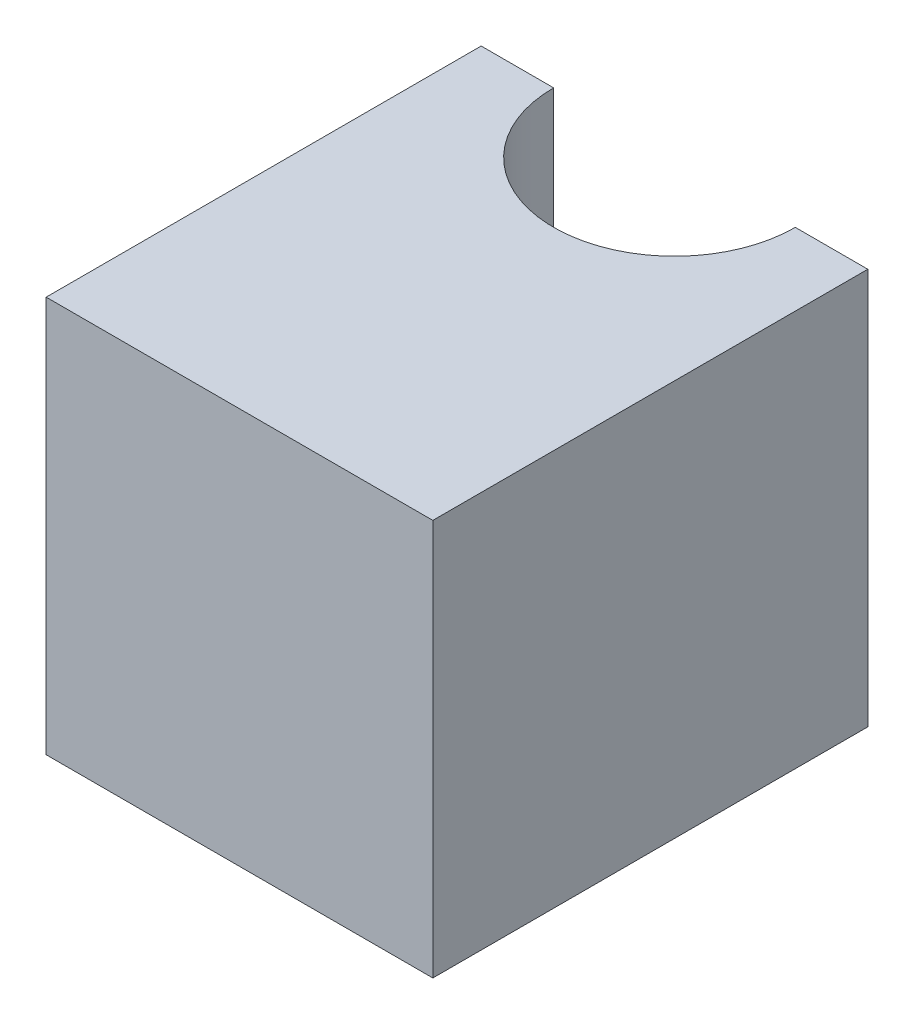
ISO-10303-21;
HEADER;
FILE_DESCRIPTION(('STEP AP214'),'2;1');
FILE_NAME('part.step','',(''),(''),'','','');
FILE_SCHEMA(('AUTOMOTIVE_DESIGN { 1 0 10303 214 1 1 1 1 }'));
ENDSEC;
DATA;
#1=APPLICATION_CONTEXT('core data for automotive mechanical design processes');
#2=APPLICATION_PROTOCOL_DEFINITION('international standard','automotive_design',2000,#1);
#3=PRODUCT_CONTEXT('',#1,'mechanical');
#4=PRODUCT('Part','Part','',(#3));
#5=PRODUCT_RELATED_PRODUCT_CATEGORY('part','',(#4));
#6=PRODUCT_DEFINITION_FORMATION('','',#4);
#7=PRODUCT_DEFINITION_CONTEXT('part definition',#1,'design');
#8=PRODUCT_DEFINITION('design','',#6,#7);
#9=PRODUCT_DEFINITION_SHAPE('','',#8);
#10=(LENGTH_UNIT() NAMED_UNIT(*) SI_UNIT(.MILLI.,.METRE.));
#11=(NAMED_UNIT(*) PLANE_ANGLE_UNIT() SI_UNIT($,.RADIAN.));
#12=(NAMED_UNIT(*) SI_UNIT($,.STERADIAN.) SOLID_ANGLE_UNIT());
#13=UNCERTAINTY_MEASURE_WITH_UNIT(LENGTH_MEASURE(1.E-05),#10,'distance_accuracy_value','');
#14=(GEOMETRIC_REPRESENTATION_CONTEXT(3) GLOBAL_UNCERTAINTY_ASSIGNED_CONTEXT((#13)) GLOBAL_UNIT_ASSIGNED_CONTEXT((#10,
#11,#12)) REPRESENTATION_CONTEXT('',''));
#15=CARTESIAN_POINT('',(0.,0.,0.));
#16=DIRECTION('',(0.,0.,1.));
#17=DIRECTION('',(1.,0.,0.));
#18=AXIS2_PLACEMENT_3D('',#15,#16,#17);
#19=CARTESIAN_POINT('',(0.8,0.,-5.2));
#20=DIRECTION('',(1.,0.,0.));
#21=DIRECTION('',(0.,0.,-1.));
#22=AXIS2_PLACEMENT_3D('',#19,#20,#21);
#23=PLANE('',#22);
#24=DIRECTION('',(0.,0.,1.));
#25=VECTOR('',#24,1.);
#26=CARTESIAN_POINT('',(0.8,0.82,-5.65));
#27=LINE('',#26,#25);
#28=CARTESIAN_POINT('',(0.8,0.82,-5.2));
#29=VERTEX_POINT('',#28);
#30=CARTESIAN_POINT('',(0.8,0.82,-6.1));
#31=VERTEX_POINT('',#30);
#32=EDGE_CURVE('E108',#29,#31,#27,.F.);
#33=ORIENTED_EDGE('',*,*,#32,.F.);
#34=DIRECTION('',(0.,1.,0.));
#35=VECTOR('',#34,1.);
#36=CARTESIAN_POINT('',(0.8,0.,-5.2));
#37=LINE('',#36,#35);
#38=CARTESIAN_POINT('',(0.8,0.,-5.2));
#39=VERTEX_POINT('',#38);
#40=EDGE_CURVE('E92',#39,#29,#37,.T.);
#41=ORIENTED_EDGE('',*,*,#40,.F.);
#42=DIRECTION('',(0.,0.,1.));
#43=VECTOR('',#42,1.);
#44=CARTESIAN_POINT('',(0.8,0.,-5.65));
#45=LINE('',#44,#43);
#46=CARTESIAN_POINT('',(0.8,0.,-6.1));
#47=VERTEX_POINT('',#46);
#48=EDGE_CURVE('E76',#39,#47,#45,.F.);
#49=ORIENTED_EDGE('',*,*,#48,.T.);
#50=DIRECTION('',(0.,1.,0.));
#51=VECTOR('',#50,1.);
#52=CARTESIAN_POINT('',(0.8,0.,-6.1));
#53=LINE('',#52,#51);
#54=EDGE_CURVE('E73',#31,#47,#53,.F.);
#55=ORIENTED_EDGE('',*,*,#54,.F.);
#56=EDGE_LOOP('',(#33,#41,#49,#55));
#57=FACE_BOUND('',#56,.T.);
#58=ADVANCED_FACE('F17',(#57),#23,.T.);
#59=CARTESIAN_POINT('',(0.8,0.,-6.1));
#60=DIRECTION('',(0.,0.,-1.));
#61=DIRECTION('',(-1.,0.,0.));
#62=AXIS2_PLACEMENT_3D('',#59,#60,#61);
#63=PLANE('',#62);
#64=DIRECTION('',(1.,0.,0.));
#65=VECTOR('',#64,1.);
#66=CARTESIAN_POINT('',(0.4,0.82,-6.1));
#67=LINE('',#66,#65);
#68=CARTESIAN_POINT('',(0.65,0.82,-6.1));
#69=VERTEX_POINT('',#68);
#70=EDGE_CURVE('E106',#31,#69,#67,.F.);
#71=ORIENTED_EDGE('',*,*,#70,.F.);
#72=ORIENTED_EDGE('',*,*,#54,.T.);
#73=DIRECTION('',(1.,0.,0.));
#74=VECTOR('',#73,1.);
#75=CARTESIAN_POINT('',(0.4,0.,-6.1));
#76=LINE('',#75,#74);
#77=CARTESIAN_POINT('',(0.65,0.,-6.1));
#78=VERTEX_POINT('',#77);
#79=EDGE_CURVE('E67',#47,#78,#76,.F.);
#80=ORIENTED_EDGE('',*,*,#79,.T.);
#81=DIRECTION('',(0.,1.,0.));
#82=VECTOR('',#81,1.);
#83=CARTESIAN_POINT('',(0.65,0.,-6.1));
#84=LINE('',#83,#82);
#85=EDGE_CURVE('E71',#78,#69,#84,.T.);
#86=ORIENTED_EDGE('',*,*,#85,.T.);
#87=EDGE_LOOP('',(#71,#72,#80,#86));
#88=FACE_BOUND('',#87,.T.);
#89=ADVANCED_FACE('F70',(#88),#63,.T.);
#90=CARTESIAN_POINT('',(0.4,0.,-6.1));
#91=DIRECTION('',(0.,1.,0.));
#92=DIRECTION('',(0.,0.,1.));
#93=AXIS2_PLACEMENT_3D('',#90,#91,#92);
#94=CYLINDRICAL_SURFACE('',#93,0.25);
#95=DIRECTION('',(0.,1.,0.));
#96=VECTOR('',#95,1.);
#97=CARTESIAN_POINT('',(0.15,0.,-6.1));
#98=LINE('',#97,#96);
#99=CARTESIAN_POINT('',(0.15,0.82,-6.1));
#100=VERTEX_POINT('',#99);
#101=CARTESIAN_POINT('',(0.15,0.,-6.1));
#102=VERTEX_POINT('',#101);
#103=EDGE_CURVE('E117',#100,#102,#98,.F.);
#104=ORIENTED_EDGE('',*,*,#103,.F.);
#105=CARTESIAN_POINT('',(0.4,0.82,-6.1));
#106=DIRECTION('',(0.,1.,0.));
#107=DIRECTION('',(0.,0.,1.));
#108=AXIS2_PLACEMENT_3D('',#105,#106,#107);
#109=CIRCLE('',#108,0.25);
#110=EDGE_CURVE('E83',#69,#100,#109,.F.);
#111=ORIENTED_EDGE('',*,*,#110,.F.);
#112=ORIENTED_EDGE('',*,*,#85,.F.);
#113=CARTESIAN_POINT('',(0.4,0.,-6.1));
#114=DIRECTION('',(0.,1.,0.));
#115=DIRECTION('',(0.,0.,1.));
#116=AXIS2_PLACEMENT_3D('',#113,#114,#115);
#117=CIRCLE('',#116,0.25);
#118=EDGE_CURVE('E20',#78,#102,#117,.F.);
#119=ORIENTED_EDGE('',*,*,#118,.T.);
#120=EDGE_LOOP('',(#104,#111,#112,#119));
#121=FACE_BOUND('',#120,.T.);
#122=ADVANCED_FACE('F81',(#121),#94,.F.);
#123=CARTESIAN_POINT('',(0.4,0.,-5.65));
#124=DIRECTION('',(0.,1.,0.));
#125=DIRECTION('',(0.,0.,1.));
#126=AXIS2_PLACEMENT_3D('',#123,#124,#125);
#127=PLANE('',#126);
#128=DIRECTION('',(0.,0.,1.));
#129=VECTOR('',#128,1.);
#130=CARTESIAN_POINT('',(0.,0.,-6.1));
#131=LINE('',#130,#129);
#132=CARTESIAN_POINT('',(0.,0.,-6.1));
#133=VERTEX_POINT('',#132);
#134=CARTESIAN_POINT('',(0.,0.,-5.2));
#135=VERTEX_POINT('',#134);
#136=EDGE_CURVE('E119',#133,#135,#131,.T.);
#137=ORIENTED_EDGE('',*,*,#136,.F.);
#138=DIRECTION('',(-1.,0.,0.));
#139=VECTOR('',#138,1.);
#140=CARTESIAN_POINT('',(0.15,0.,-6.1));
#141=LINE('',#140,#139);
#142=EDGE_CURVE('E88',#102,#133,#141,.T.);
#143=ORIENTED_EDGE('',*,*,#142,.F.);
#144=ORIENTED_EDGE('',*,*,#118,.F.);
#145=ORIENTED_EDGE('',*,*,#79,.F.);
#146=ORIENTED_EDGE('',*,*,#48,.F.);
#147=DIRECTION('',(1.,0.,0.));
#148=VECTOR('',#147,1.);
#149=CARTESIAN_POINT('',(0.,0.,-5.2));
#150=LINE('',#149,#148);
#151=EDGE_CURVE('E90',#135,#39,#150,.T.);
#152=ORIENTED_EDGE('',*,*,#151,.F.);
#153=EDGE_LOOP('',(#137,#143,#144,#145,#146,#152));
#154=FACE_BOUND('',#153,.T.);
#155=ADVANCED_FACE('F86',(#154),#127,.F.);
#156=CARTESIAN_POINT('',(0.,0.,-5.2));
#157=DIRECTION('',(0.,0.,1.));
#158=DIRECTION('',(1.,0.,0.));
#159=AXIS2_PLACEMENT_3D('',#156,#157,#158);
#160=PLANE('',#159);
#161=DIRECTION('',(1.,0.,0.));
#162=VECTOR('',#161,1.);
#163=CARTESIAN_POINT('',(0.4,0.82,-5.2));
#164=LINE('',#163,#162);
#165=CARTESIAN_POINT('',(0.,0.82,-5.2));
#166=VERTEX_POINT('',#165);
#167=EDGE_CURVE('E96',#166,#29,#164,.T.);
#168=ORIENTED_EDGE('',*,*,#167,.F.);
#169=DIRECTION('',(0.,1.,0.));
#170=VECTOR('',#169,1.);
#171=CARTESIAN_POINT('',(0.,0.,-5.2));
#172=LINE('',#171,#170);
#173=EDGE_CURVE('E127',#135,#166,#172,.T.);
#174=ORIENTED_EDGE('',*,*,#173,.F.);
#175=ORIENTED_EDGE('',*,*,#151,.T.);
#176=ORIENTED_EDGE('',*,*,#40,.T.);
#177=EDGE_LOOP('',(#168,#174,#175,#176));
#178=FACE_BOUND('',#177,.T.);
#179=ADVANCED_FACE('F149',(#178),#160,.T.);
#180=CARTESIAN_POINT('',(0.4,0.82,-5.65));
#181=DIRECTION('',(0.,1.,0.));
#182=DIRECTION('',(0.,0.,1.));
#183=AXIS2_PLACEMENT_3D('',#180,#181,#182);
#184=PLANE('',#183);
#185=DIRECTION('',(-1.,0.,0.));
#186=VECTOR('',#185,1.);
#187=CARTESIAN_POINT('',(0.15,0.82,-6.1));
#188=LINE('',#187,#186);
#189=CARTESIAN_POINT('',(0.,0.82,-6.1));
#190=VERTEX_POINT('',#189);
#191=EDGE_CURVE('E35',#190,#100,#188,.F.);
#192=ORIENTED_EDGE('',*,*,#191,.F.);
#193=DIRECTION('',(0.,0.,1.));
#194=VECTOR('',#193,1.);
#195=CARTESIAN_POINT('',(0.,0.82,-6.1));
#196=LINE('',#195,#194);
#197=EDGE_CURVE('E26',#166,#190,#196,.F.);
#198=ORIENTED_EDGE('',*,*,#197,.F.);
#199=ORIENTED_EDGE('',*,*,#167,.T.);
#200=ORIENTED_EDGE('',*,*,#32,.T.);
#201=ORIENTED_EDGE('',*,*,#70,.T.);
#202=ORIENTED_EDGE('',*,*,#110,.T.);
#203=EDGE_LOOP('',(#192,#198,#199,#200,#201,#202));
#204=FACE_BOUND('',#203,.T.);
#205=ADVANCED_FACE('F152',(#204),#184,.T.);
#206=CARTESIAN_POINT('',(0.15,0.,-6.1));
#207=DIRECTION('',(0.,0.,-1.));
#208=DIRECTION('',(-1.,0.,0.));
#209=AXIS2_PLACEMENT_3D('',#206,#207,#208);
#210=PLANE('',#209);
#211=ORIENTED_EDGE('',*,*,#191,.T.);
#212=ORIENTED_EDGE('',*,*,#103,.T.);
#213=ORIENTED_EDGE('',*,*,#142,.T.);
#214=DIRECTION('',(0.,1.,0.));
#215=VECTOR('',#214,1.);
#216=CARTESIAN_POINT('',(0.,0.,-6.1));
#217=LINE('',#216,#215);
#218=EDGE_CURVE('E11',#190,#133,#217,.F.);
#219=ORIENTED_EDGE('',*,*,#218,.F.);
#220=EDGE_LOOP('',(#211,#212,#213,#219));
#221=FACE_BOUND('',#220,.T.);
#222=ADVANCED_FACE('F154',(#221),#210,.T.);
#223=CARTESIAN_POINT('',(0.,0.,-6.1));
#224=DIRECTION('',(-1.,0.,0.));
#225=DIRECTION('',(0.,0.,1.));
#226=AXIS2_PLACEMENT_3D('',#223,#224,#225);
#227=PLANE('',#226);
#228=ORIENTED_EDGE('',*,*,#197,.T.);
#229=ORIENTED_EDGE('',*,*,#218,.T.);
#230=ORIENTED_EDGE('',*,*,#136,.T.);
#231=ORIENTED_EDGE('',*,*,#173,.T.);
#232=EDGE_LOOP('',(#228,#229,#230,#231));
#233=FACE_BOUND('',#232,.T.);
#234=ADVANCED_FACE('F148',(#233),#227,.T.);
#235=CLOSED_SHELL('',(#58,#89,#122,#155,#179,#205,#222,#234));
#236=MANIFOLD_SOLID_BREP('B1',#235);
#237=ADVANCED_BREP_SHAPE_REPRESENTATION('',(#18,#236),#14);
#238=SHAPE_DEFINITION_REPRESENTATION(#9,#237);
ENDSEC;
END-ISO-10303-21;
